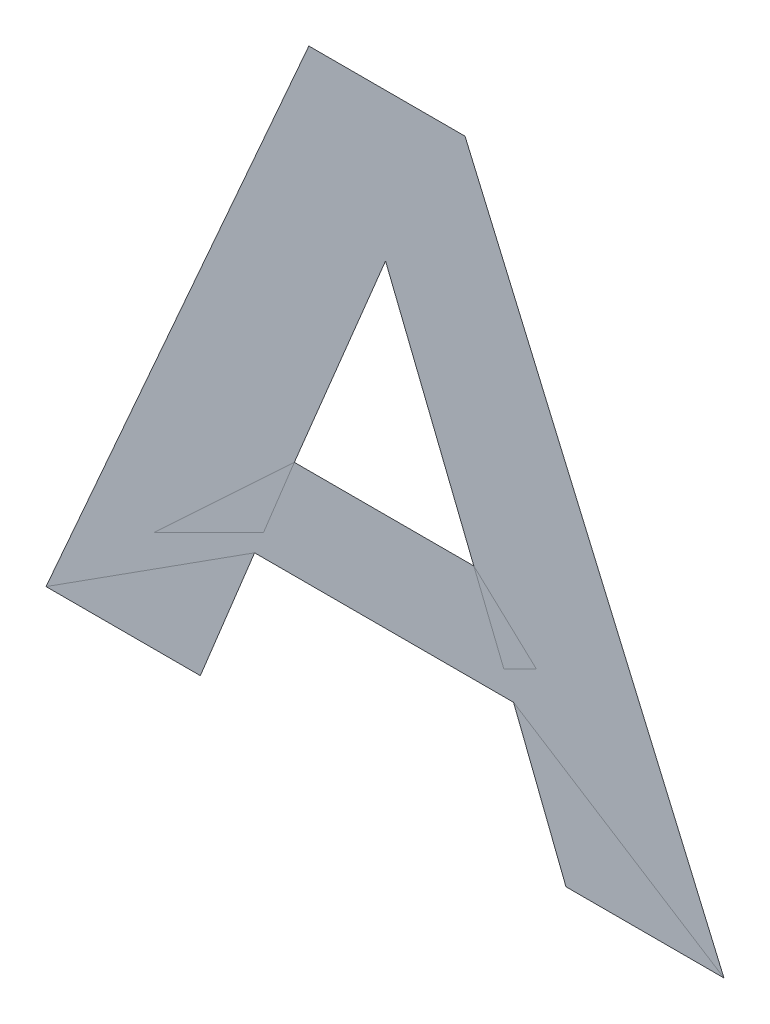
ISO-10303-21;
HEADER;
FILE_DESCRIPTION(('STEP AP214'),'2;1');
FILE_NAME('part.step','',(''),(''),'','','');
FILE_SCHEMA(('AUTOMOTIVE_DESIGN { 1 0 10303 214 1 1 1 1 }'));
ENDSEC;
DATA;
#1=APPLICATION_CONTEXT('core data for automotive mechanical design processes');
#2=APPLICATION_PROTOCOL_DEFINITION('international standard','automotive_design',2000,#1);
#3=PRODUCT_CONTEXT('',#1,'mechanical');
#4=PRODUCT('Part','Part','',(#3));
#5=PRODUCT_RELATED_PRODUCT_CATEGORY('part','',(#4));
#6=PRODUCT_DEFINITION_FORMATION('','',#4);
#7=PRODUCT_DEFINITION_CONTEXT('part definition',#1,'design');
#8=PRODUCT_DEFINITION('design','',#6,#7);
#9=PRODUCT_DEFINITION_SHAPE('','',#8);
#10=(LENGTH_UNIT() NAMED_UNIT(*) SI_UNIT(.MILLI.,.METRE.));
#11=(NAMED_UNIT(*) PLANE_ANGLE_UNIT() SI_UNIT($,.RADIAN.));
#12=(NAMED_UNIT(*) SI_UNIT($,.STERADIAN.) SOLID_ANGLE_UNIT());
#13=UNCERTAINTY_MEASURE_WITH_UNIT(LENGTH_MEASURE(1.E-05),#10,'distance_accuracy_value','');
#14=(GEOMETRIC_REPRESENTATION_CONTEXT(3) GLOBAL_UNCERTAINTY_ASSIGNED_CONTEXT((#13)) GLOBAL_UNIT_ASSIGNED_CONTEXT((#10,
#11,#12)) REPRESENTATION_CONTEXT('',''));
#15=CARTESIAN_POINT('',(0.,0.,0.));
#16=DIRECTION('',(0.,0.,1.));
#17=DIRECTION('',(1.,0.,0.));
#18=AXIS2_PLACEMENT_3D('',#15,#16,#17);
#19=CARTESIAN_POINT('',(0.058612432551,0.773280378382,0.));
#20=DIRECTION('',(0.,0.,1.));
#21=DIRECTION('',(1.,0.,0.));
#22=AXIS2_PLACEMENT_3D('',#19,#20,#21);
#23=PLANE('',#22);
#24=CARTESIAN_POINT('',(0.05880544080105,0.832647784412,0.00045));
#25=DIRECTION('',(0.369024709495312,-0.929419584354613,0.));
#26=VECTOR('',#25,1.);
#27=LINE('',#24,#26);
#28=CARTESIAN_POINT('',(0.058683543026025,0.832647784412,0.000225));
#29=VERTEX_POINT('',#28);
#30=CARTESIAN_POINT('',(0.07028437390095,0.803737131667,0.000225));
#31=VERTEX_POINT('',#30);
#32=EDGE_CURVE('E11',#29,#31,#27,.T.);
#33=ORIENTED_EDGE('',*,*,#32,.F.);
#34=CARTESIAN_POINT('',(0.046696695651,0.803737131667,0.00045));
#35=DIRECTION('',(0.37967053947963,0.925121765742892,0.));
#36=VECTOR('',#35,1.);
#37=LINE('',#34,#36);
#38=CARTESIAN_POINT('',(0.046696695651,0.803737131667,0.000225));
#39=VERTEX_POINT('',#38);
#40=EDGE_CURVE('E28',#39,#29,#37,.T.);
#41=ORIENTED_EDGE('',*,*,#40,.F.);
#42=CARTESIAN_POINT('',(0.07028437390095,0.803737131667,0.00045));
#43=DIRECTION('',(-1.,0.,0.));
#44=VECTOR('',#43,1.);
#45=LINE('',#42,#44);
#46=EDGE_CURVE('E79',#31,#39,#45,.T.);
#47=ORIENTED_EDGE('',*,*,#46,.F.);
#48=EDGE_LOOP('',(#33,#41,#47));
#49=FACE_BOUND('',#48,.T.);
#50=CARTESIAN_POINT('',(0.103156780851,0.773280378382,0.00045));
#51=DIRECTION('',(-0.396508989815125,0.918030838804334,0.));
#52=VECTOR('',#51,1.);
#53=LINE('',#50,#52);
#54=CARTESIAN_POINT('',(0.103156780851,0.773280378382,0.000225));
#55=VERTEX_POINT('',#54);
#56=CARTESIAN_POINT('',(0.06912632440095,0.852070542747,0.000225));
#57=VERTEX_POINT('',#56);
#58=EDGE_CURVE('E68',#55,#57,#53,.T.);
#59=ORIENTED_EDGE('',*,*,#58,.F.);
#60=CARTESIAN_POINT('',(0.08239312540095,0.773280378382,0.00045));
#61=DIRECTION('',(1.,0.,0.));
#62=VECTOR('',#61,1.);
#63=LINE('',#60,#62);
#64=CARTESIAN_POINT('',(0.08239312540095,0.773280378382,0.000225));
#65=VERTEX_POINT('',#64);
#66=EDGE_CURVE('E77',#65,#55,#63,.T.);
#67=ORIENTED_EDGE('',*,*,#66,.F.);
#68=CARTESIAN_POINT('',(0.075505763001,0.790827905517,0.00045));
#69=DIRECTION('',(0.365362421983327,-0.93086535041459,0.));
#70=VECTOR('',#69,1.);
#71=LINE('',#68,#70);
#72=CARTESIAN_POINT('',(0.075505763001,0.790827905517,0.000225));
#73=VERTEX_POINT('',#72);
#74=EDGE_CURVE('E181',#73,#65,#71,.T.);
#75=ORIENTED_EDGE('',*,*,#74,.F.);
#76=CARTESIAN_POINT('',(0.04147530655095,0.790827905517,0.00045));
#77=DIRECTION('',(1.,0.,0.));
#78=VECTOR('',#77,1.);
#79=LINE('',#76,#78);
#80=CARTESIAN_POINT('',(0.04147530655095,0.790827905517,0.000225));
#81=VERTEX_POINT('',#80);
#82=EDGE_CURVE('E179',#81,#73,#79,.T.);
#83=ORIENTED_EDGE('',*,*,#82,.F.);
#84=CARTESIAN_POINT('',(0.03434414860095,0.773280378382,0.00045));
#85=DIRECTION('',(0.376489203734772,0.926421005521333,0.));
#86=VECTOR('',#85,1.);
#87=LINE('',#84,#86);
#88=CARTESIAN_POINT('',(0.03434414860095,0.773280378382,0.000225));
#89=VERTEX_POINT('',#88);
#90=EDGE_CURVE('E178',#89,#81,#87,.T.);
#91=ORIENTED_EDGE('',*,*,#90,.F.);
#92=CARTESIAN_POINT('',(0.014068084251,0.773280378382,0.00045));
#93=DIRECTION('',(1.,0.,0.));
#94=VECTOR('',#93,1.);
#95=LINE('',#92,#94);
#96=CARTESIAN_POINT('',(0.014068084251,0.773280378382,0.000225));
#97=VERTEX_POINT('',#96);
#98=EDGE_CURVE('E176',#97,#89,#95,.T.);
#99=ORIENTED_EDGE('',*,*,#98,.F.);
#100=CARTESIAN_POINT('',(0.04860646450095,0.852070542747,0.00045));
#101=DIRECTION('',(-0.401479093118795,-0.915868187998966,0.));
#102=VECTOR('',#101,1.);
#103=LINE('',#100,#102);
#104=CARTESIAN_POINT('',(0.04860646450095,0.852070542747,0.000225));
#105=VERTEX_POINT('',#104);
#106=EDGE_CURVE('E63',#105,#97,#103,.T.);
#107=ORIENTED_EDGE('',*,*,#106,.F.);
#108=CARTESIAN_POINT('',(0.06912632440095,0.852070542747,0.00045));
#109=DIRECTION('',(-1.,0.,0.));
#110=VECTOR('',#109,1.);
#111=LINE('',#108,#110);
#112=EDGE_CURVE('E66',#57,#105,#111,.T.);
#113=ORIENTED_EDGE('',*,*,#112,.F.);
#114=EDGE_LOOP('',(#59,#67,#75,#83,#91,#99,#107,#113));
#115=FACE_BOUND('',#114,.T.);
#116=ADVANCED_FACE('F17',(#49,#115),#23,.F.);
#117=CARTESIAN_POINT('',(0.058612432551,0.773280378382,0.00045));
#118=DIRECTION('',(0.,0.,1.));
#119=DIRECTION('',(1.,0.,0.));
#120=AXIS2_PLACEMENT_3D('',#117,#118,#119);
#121=PLANE('',#120);
#122=ORIENTED_EDGE('',*,*,#40,.T.);
#123=ORIENTED_EDGE('',*,*,#32,.T.);
#124=ORIENTED_EDGE('',*,*,#46,.T.);
#125=EDGE_LOOP('',(#122,#123,#124));
#126=FACE_BOUND('',#125,.T.);
#127=ORIENTED_EDGE('',*,*,#66,.T.);
#128=ORIENTED_EDGE('',*,*,#58,.T.);
#129=ORIENTED_EDGE('',*,*,#112,.T.);
#130=ORIENTED_EDGE('',*,*,#106,.T.);
#131=ORIENTED_EDGE('',*,*,#98,.T.);
#132=ORIENTED_EDGE('',*,*,#90,.T.);
#133=ORIENTED_EDGE('',*,*,#82,.T.);
#134=ORIENTED_EDGE('',*,*,#74,.T.);
#135=EDGE_LOOP('',(#127,#128,#129,#130,#131,#132,#133,#134));
#136=FACE_BOUND('',#135,.T.);
#137=ADVANCED_FACE('F75',(#126,#136),#121,.T.);
#138=CLOSED_SHELL('',(#116,#137));
#139=MANIFOLD_SOLID_BREP('B1',#138);
#140=ADVANCED_BREP_SHAPE_REPRESENTATION('',(#18,#139),#14);
#141=SHAPE_DEFINITION_REPRESENTATION(#9,#140);
ENDSEC;
END-ISO-10303-21;
